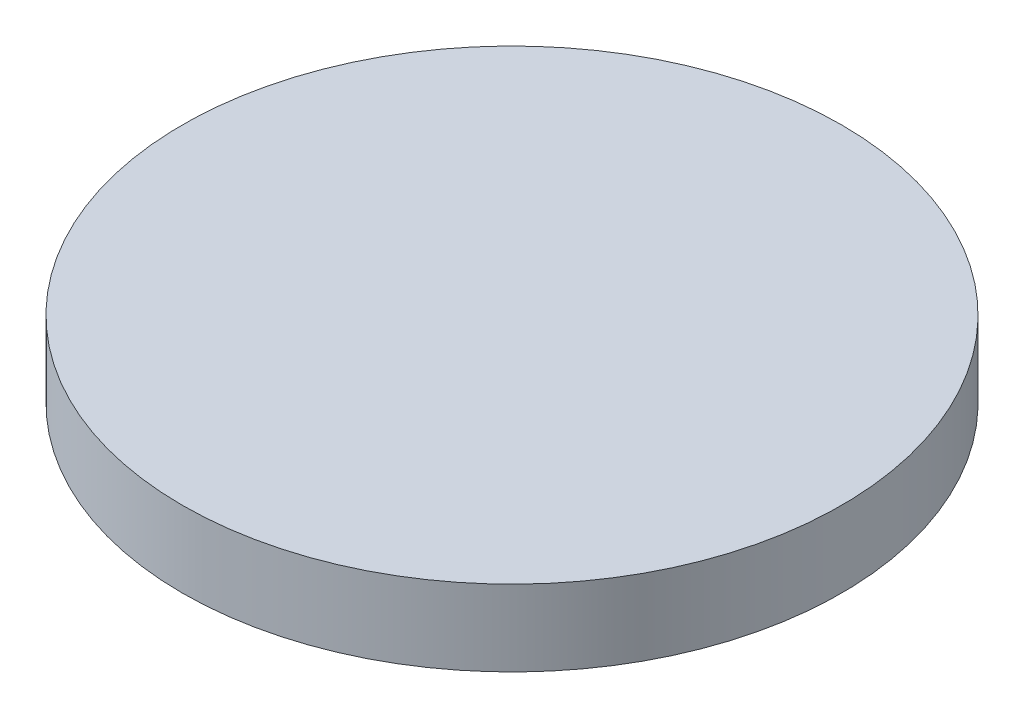
ISO-10303-21;
HEADER;
FILE_DESCRIPTION(('STEP AP214'),'2;1');
FILE_NAME('part.step','',(''),(''),'','','');
FILE_SCHEMA(('AUTOMOTIVE_DESIGN { 1 0 10303 214 1 1 1 1 }'));
ENDSEC;
DATA;
#1=APPLICATION_CONTEXT('core data for automotive mechanical design processes');
#2=APPLICATION_PROTOCOL_DEFINITION('international standard','automotive_design',2000,#1);
#3=PRODUCT_CONTEXT('',#1,'mechanical');
#4=PRODUCT('Part','Part','',(#3));
#5=PRODUCT_RELATED_PRODUCT_CATEGORY('part','',(#4));
#6=PRODUCT_DEFINITION_FORMATION('','',#4);
#7=PRODUCT_DEFINITION_CONTEXT('part definition',#1,'design');
#8=PRODUCT_DEFINITION('design','',#6,#7);
#9=PRODUCT_DEFINITION_SHAPE('','',#8);
#10=(LENGTH_UNIT() NAMED_UNIT(*) SI_UNIT(.MILLI.,.METRE.));
#11=(NAMED_UNIT(*) PLANE_ANGLE_UNIT() SI_UNIT($,.RADIAN.));
#12=(NAMED_UNIT(*) SI_UNIT($,.STERADIAN.) SOLID_ANGLE_UNIT());
#13=UNCERTAINTY_MEASURE_WITH_UNIT(LENGTH_MEASURE(1.E-05),#10,'distance_accuracy_value','');
#14=(GEOMETRIC_REPRESENTATION_CONTEXT(3) GLOBAL_UNCERTAINTY_ASSIGNED_CONTEXT((#13)) GLOBAL_UNIT_ASSIGNED_CONTEXT((#10,
#11,#12)) REPRESENTATION_CONTEXT('',''));
#15=CARTESIAN_POINT('',(0.,0.,0.));
#16=DIRECTION('',(0.,0.,1.));
#17=DIRECTION('',(1.,0.,0.));
#18=AXIS2_PLACEMENT_3D('',#15,#16,#17);
#19=CARTESIAN_POINT('',(0.,5.,0.));
#20=DIRECTION('',(0.,-1.,0.));
#21=DIRECTION('',(0.,0.,-1.));
#22=AXIS2_PLACEMENT_3D('',#19,#20,#21);
#23=CYLINDRICAL_SURFACE('',#22,30.);
#24=CARTESIAN_POINT('',(0.,5.,0.));
#25=DIRECTION('',(0.,1.,0.));
#26=DIRECTION('',(0.,0.,1.));
#27=AXIS2_PLACEMENT_3D('',#24,#25,#26);
#28=CIRCLE('',#27,30.);
#29=CARTESIAN_POINT('',(0.,5.,30.));
#30=VERTEX_POINT('',#29);
#31=EDGE_CURVE('E10',#30,#30,#28,.T.);
#32=ORIENTED_EDGE('',*,*,#31,.F.);
#33=EDGE_LOOP('',(#32));
#34=FACE_BOUND('',#33,.T.);
#35=CARTESIAN_POINT('',(0.,0.,0.));
#36=DIRECTION('',(0.,1.,0.));
#37=DIRECTION('',(0.,0.,1.));
#38=AXIS2_PLACEMENT_3D('',#35,#36,#37);
#39=CIRCLE('',#38,30.);
#40=CARTESIAN_POINT('',(0.,0.,30.));
#41=VERTEX_POINT('',#40);
#42=EDGE_CURVE('E37',#41,#41,#39,.T.);
#43=ORIENTED_EDGE('',*,*,#42,.T.);
#44=EDGE_LOOP('',(#43));
#45=FACE_BOUND('',#44,.T.);
#46=ADVANCED_FACE('F34',(#34,#45),#23,.T.);
#47=CARTESIAN_POINT('',(0.,0.,0.));
#48=DIRECTION('',(0.,1.,0.));
#49=DIRECTION('',(0.,0.,1.));
#50=AXIS2_PLACEMENT_3D('',#47,#48,#49);
#51=PLANE('',#50);
#52=ORIENTED_EDGE('',*,*,#42,.F.);
#53=EDGE_LOOP('',(#52));
#54=FACE_BOUND('',#53,.T.);
#55=ADVANCED_FACE('F57',(#54),#51,.F.);
#56=CARTESIAN_POINT('',(0.,14.,0.));
#57=DIRECTION('',(0.,-1.,0.));
#58=DIRECTION('',(0.,0.,-1.));
#59=AXIS2_PLACEMENT_3D('',#56,#57,#58);
#60=CYLINDRICAL_SURFACE('',#59,39.);
#61=CARTESIAN_POINT('',(0.,14.,0.));
#62=DIRECTION('',(0.,1.,0.));
#63=DIRECTION('',(0.,0.,1.));
#64=AXIS2_PLACEMENT_3D('',#61,#62,#63);
#65=CIRCLE('',#64,39.);
#66=CARTESIAN_POINT('',(0.,14.,39.));
#67=VERTEX_POINT('',#66);
#68=EDGE_CURVE('E44',#67,#67,#65,.T.);
#69=ORIENTED_EDGE('',*,*,#68,.F.);
#70=EDGE_LOOP('',(#69));
#71=FACE_BOUND('',#70,.T.);
#72=CARTESIAN_POINT('',(0.,5.,0.));
#73=DIRECTION('',(0.,1.,0.));
#74=DIRECTION('',(0.,0.,1.));
#75=AXIS2_PLACEMENT_3D('',#72,#73,#74);
#76=CIRCLE('',#75,39.);
#77=CARTESIAN_POINT('',(0.,5.,39.));
#78=VERTEX_POINT('',#77);
#79=EDGE_CURVE('E46',#78,#78,#76,.T.);
#80=ORIENTED_EDGE('',*,*,#79,.T.);
#81=EDGE_LOOP('',(#80));
#82=FACE_BOUND('',#81,.T.);
#83=ADVANCED_FACE('F54',(#71,#82),#60,.T.);
#84=CARTESIAN_POINT('',(0.,14.,0.));
#85=DIRECTION('',(0.,1.,0.));
#86=DIRECTION('',(0.,0.,1.));
#87=AXIS2_PLACEMENT_3D('',#84,#85,#86);
#88=PLANE('',#87);
#89=ORIENTED_EDGE('',*,*,#68,.T.);
#90=EDGE_LOOP('',(#89));
#91=FACE_BOUND('',#90,.T.);
#92=ADVANCED_FACE('F52',(#91),#88,.T.);
#93=CARTESIAN_POINT('',(0.,5.,0.));
#94=DIRECTION('',(0.,1.,0.));
#95=DIRECTION('',(0.,0.,1.));
#96=AXIS2_PLACEMENT_3D('',#93,#94,#95);
#97=PLANE('',#96);
#98=ORIENTED_EDGE('',*,*,#31,.T.);
#99=EDGE_LOOP('',(#98));
#100=FACE_BOUND('',#99,.T.);
#101=ORIENTED_EDGE('',*,*,#79,.F.);
#102=EDGE_LOOP('',(#101));
#103=FACE_BOUND('',#102,.T.);
#104=ADVANCED_FACE('F61',(#100,#103),#97,.F.);
#105=CLOSED_SHELL('',(#46,#55,#83,#92,#104));
#106=MANIFOLD_SOLID_BREP('B2',#105);
#107=ADVANCED_BREP_SHAPE_REPRESENTATION('',(#18,#106),#14);
#108=SHAPE_DEFINITION_REPRESENTATION(#9,#107);
ENDSEC;
END-ISO-10303-21;
